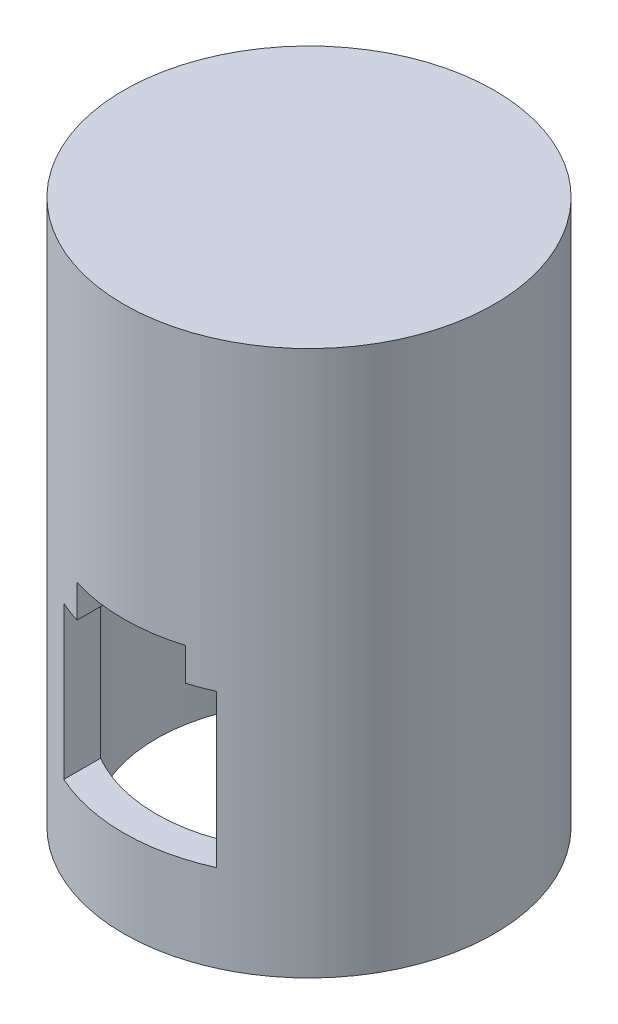
ISO-10303-21;
HEADER;
FILE_DESCRIPTION(('STEP AP214'),'2;1');
FILE_NAME('part.step','',(''),(''),'','','');
FILE_SCHEMA(('AUTOMOTIVE_DESIGN { 1 0 10303 214 1 1 1 1 }'));
ENDSEC;
DATA;
#1=APPLICATION_CONTEXT('core data for automotive mechanical design processes');
#2=APPLICATION_PROTOCOL_DEFINITION('international standard','automotive_design',2000,#1);
#3=PRODUCT_CONTEXT('',#1,'mechanical');
#4=PRODUCT('Part','Part','',(#3));
#5=PRODUCT_RELATED_PRODUCT_CATEGORY('part','',(#4));
#6=PRODUCT_DEFINITION_FORMATION('','',#4);
#7=PRODUCT_DEFINITION_CONTEXT('part definition',#1,'design');
#8=PRODUCT_DEFINITION('design','',#6,#7);
#9=PRODUCT_DEFINITION_SHAPE('','',#8);
#10=(LENGTH_UNIT() NAMED_UNIT(*) SI_UNIT(.MILLI.,.METRE.));
#11=(NAMED_UNIT(*) PLANE_ANGLE_UNIT() SI_UNIT($,.RADIAN.));
#12=(NAMED_UNIT(*) SI_UNIT($,.STERADIAN.) SOLID_ANGLE_UNIT());
#13=UNCERTAINTY_MEASURE_WITH_UNIT(LENGTH_MEASURE(1.E-05),#10,'distance_accuracy_value','');
#14=(GEOMETRIC_REPRESENTATION_CONTEXT(3) GLOBAL_UNCERTAINTY_ASSIGNED_CONTEXT((#13)) GLOBAL_UNIT_ASSIGNED_CONTEXT((#10,
#11,#12)) REPRESENTATION_CONTEXT('',''));
#15=CARTESIAN_POINT('',(0.,0.,0.));
#16=DIRECTION('',(0.,0.,1.));
#17=DIRECTION('',(1.,0.,0.));
#18=AXIS2_PLACEMENT_3D('',#15,#16,#17);
#19=CARTESIAN_POINT('',(7.,22.,-17.));
#20=DIRECTION('',(0.,1.,0.));
#21=DIRECTION('',(-1.,0.,0.));
#22=AXIS2_PLACEMENT_3D('',#19,#20,#21);
#23=PLANE('',#22);
#24=CARTESIAN_POINT('',(0.,22.,0.));
#25=DIRECTION('',(0.,1.,0.));
#26=DIRECTION('',(-1.,0.,0.));
#27=AXIS2_PLACEMENT_3D('',#24,#25,#26);
#28=CIRCLE('',#27,17.);
#29=CARTESIAN_POINT('',(-5.04900382672982,22.,-16.2329159536316));
#30=VERTEX_POINT('',#29);
#31=CARTESIAN_POINT('',(-7.,22.,-15.4919333848297));
#32=VERTEX_POINT('',#31);
#33=EDGE_CURVE('E240',#30,#32,#28,.T.);
#34=ORIENTED_EDGE('',*,*,#33,.F.);
#35=DIRECTION('',(0.,0.,1.));
#36=VECTOR('',#35,1.);
#37=CARTESIAN_POINT('',(-5.04900382672982,22.,-17.));
#38=LINE('',#37,#36);
#39=CARTESIAN_POINT('',(-5.04900382672982,22.,-13.0578543550488));
#40=VERTEX_POINT('',#39);
#41=EDGE_CURVE('E193',#30,#40,#38,.T.);
#42=ORIENTED_EDGE('',*,*,#41,.T.);
#43=CARTESIAN_POINT('',(0.,22.,0.));
#44=DIRECTION('',(0.,1.,0.));
#45=DIRECTION('',(-1.,0.,0.));
#46=AXIS2_PLACEMENT_3D('',#43,#44,#45);
#47=CIRCLE('',#46,14.);
#48=CARTESIAN_POINT('',(-7.,22.,-12.1243556529821));
#49=VERTEX_POINT('',#48);
#50=EDGE_CURVE('E275',#49,#40,#47,.F.);
#51=ORIENTED_EDGE('',*,*,#50,.F.);
#52=DIRECTION('',(0.,0.,1.));
#53=VECTOR('',#52,1.);
#54=CARTESIAN_POINT('',(-7.,22.,-17.));
#55=LINE('',#54,#53);
#56=EDGE_CURVE('E213',#32,#49,#55,.T.);
#57=ORIENTED_EDGE('',*,*,#56,.F.);
#58=EDGE_LOOP('',(#34,#42,#51,#57));
#59=FACE_BOUND('',#58,.T.);
#60=ADVANCED_FACE('F39',(#59),#23,.F.);
#61=CARTESIAN_POINT('',(-5.04900382672982,22.,13.0578543550488));
#62=VERTEX_POINT('',#61);
#63=CARTESIAN_POINT('',(-7.,22.,12.1243556529821));
#64=VERTEX_POINT('',#63);
#65=EDGE_CURVE('E288',#62,#64,#47,.F.);
#66=ORIENTED_EDGE('',*,*,#65,.F.);
#67=DIRECTION('',(0.,0.,1.));
#68=VECTOR('',#67,1.);
#69=CARTESIAN_POINT('',(-5.04900382672982,22.,-17.));
#70=LINE('',#69,#68);
#71=CARTESIAN_POINT('',(-5.04900382672982,22.,16.2329159536316));
#72=VERTEX_POINT('',#71);
#73=EDGE_CURVE('E295',#62,#72,#70,.T.);
#74=ORIENTED_EDGE('',*,*,#73,.T.);
#75=CARTESIAN_POINT('',(-7.,22.,15.4919333848297));
#76=VERTEX_POINT('',#75);
#77=EDGE_CURVE('E241',#76,#72,#28,.T.);
#78=ORIENTED_EDGE('',*,*,#77,.F.);
#79=EDGE_CURVE('E209',#64,#76,#55,.T.);
#80=ORIENTED_EDGE('',*,*,#79,.F.);
#81=EDGE_LOOP('',(#66,#74,#78,#80));
#82=FACE_BOUND('',#81,.T.);
#83=ADVANCED_FACE('F338',(#82),#23,.F.);
#84=CARTESIAN_POINT('',(0.,30.,0.));
#85=DIRECTION('',(0.,-1.,0.));
#86=DIRECTION('',(0.,0.,-1.));
#87=AXIS2_PLACEMENT_3D('',#84,#85,#86);
#88=CYLINDRICAL_SURFACE('',#87,17.);
#89=DIRECTION('',(0.,-1.,0.));
#90=VECTOR('',#89,1.);
#91=CARTESIAN_POINT('',(4.95099617327018,30.,-16.26307587427));
#92=LINE('',#91,#90);
#93=CARTESIAN_POINT('',(4.95099617327018,22.,-16.26307587427));
#94=VERTEX_POINT('',#93);
#95=CARTESIAN_POINT('',(4.95099617327018,25.,-16.26307587427));
#96=VERTEX_POINT('',#95);
#97=EDGE_CURVE('E55',#94,#96,#92,.F.);
#98=ORIENTED_EDGE('',*,*,#97,.T.);
#99=CARTESIAN_POINT('',(0.,25.,0.));
#100=DIRECTION('',(0.,1.,0.));
#101=DIRECTION('',(0.,0.,1.));
#102=AXIS2_PLACEMENT_3D('',#99,#100,#101);
#103=CIRCLE('',#102,17.);
#104=CARTESIAN_POINT('',(-5.04900382672982,25.,-16.2329159536316));
#105=VERTEX_POINT('',#104);
#106=EDGE_CURVE('E155',#96,#105,#103,.T.);
#107=ORIENTED_EDGE('',*,*,#106,.T.);
#108=DIRECTION('',(0.,-1.,0.));
#109=VECTOR('',#108,1.);
#110=CARTESIAN_POINT('',(-5.04900382672982,30.,-16.2329159536316));
#111=LINE('',#110,#109);
#112=EDGE_CURVE('E201',#105,#30,#111,.T.);
#113=ORIENTED_EDGE('',*,*,#112,.T.);
#114=ORIENTED_EDGE('',*,*,#33,.T.);
#115=DIRECTION('',(0.,-1.,0.));
#116=VECTOR('',#115,1.);
#117=CARTESIAN_POINT('',(-7.,30.,-15.4919333848297));
#118=LINE('',#117,#116);
#119=CARTESIAN_POINT('',(-7.,8.,-15.4919333848297));
#120=VERTEX_POINT('',#119);
#121=EDGE_CURVE('E250',#32,#120,#118,.T.);
#122=ORIENTED_EDGE('',*,*,#121,.T.);
#123=CARTESIAN_POINT('',(0.,8.,0.));
#124=DIRECTION('',(0.,-1.,0.));
#125=DIRECTION('',(0.,0.,-1.));
#126=AXIS2_PLACEMENT_3D('',#123,#124,#125);
#127=CIRCLE('',#126,17.);
#128=CARTESIAN_POINT('',(7.,8.,-15.4919333848297));
#129=VERTEX_POINT('',#128);
#130=EDGE_CURVE('E229',#120,#129,#127,.T.);
#131=ORIENTED_EDGE('',*,*,#130,.T.);
#132=DIRECTION('',(0.,-1.,0.));
#133=VECTOR('',#132,1.);
#134=CARTESIAN_POINT('',(7.,30.,-15.4919333848297));
#135=LINE('',#134,#133);
#136=CARTESIAN_POINT('',(7.,22.,-15.4919333848297));
#137=VERTEX_POINT('',#136);
#138=EDGE_CURVE('E233',#129,#137,#135,.F.);
#139=ORIENTED_EDGE('',*,*,#138,.T.);
#140=EDGE_CURVE('E177',#137,#94,#28,.T.);
#141=ORIENTED_EDGE('',*,*,#140,.T.);
#142=EDGE_LOOP('',(#98,#107,#113,#114,#122,#131,#139,#141));
#143=FACE_BOUND('',#142,.T.);
#144=CARTESIAN_POINT('',(-5.04900382672982,25.,16.2329159536316));
#145=VERTEX_POINT('',#144);
#146=CARTESIAN_POINT('',(4.95099617327018,25.,16.26307587427));
#147=VERTEX_POINT('',#146);
#148=EDGE_CURVE('E165',#145,#147,#103,.T.);
#149=ORIENTED_EDGE('',*,*,#148,.T.);
#150=DIRECTION('',(0.,-1.,0.));
#151=VECTOR('',#150,1.);
#152=CARTESIAN_POINT('',(4.95099617327018,30.,16.26307587427));
#153=LINE('',#152,#151);
#154=CARTESIAN_POINT('',(4.95099617327018,22.,16.26307587427));
#155=VERTEX_POINT('',#154);
#156=EDGE_CURVE('E314',#147,#155,#153,.T.);
#157=ORIENTED_EDGE('',*,*,#156,.T.);
#158=CARTESIAN_POINT('',(7.,22.,15.4919333848297));
#159=VERTEX_POINT('',#158);
#160=EDGE_CURVE('E246',#155,#159,#28,.T.);
#161=ORIENTED_EDGE('',*,*,#160,.T.);
#162=DIRECTION('',(0.,-1.,0.));
#163=VECTOR('',#162,1.);
#164=CARTESIAN_POINT('',(7.,30.,15.4919333848297));
#165=LINE('',#164,#163);
#166=CARTESIAN_POINT('',(7.,8.,15.4919333848297));
#167=VERTEX_POINT('',#166);
#168=EDGE_CURVE('E236',#159,#167,#165,.T.);
#169=ORIENTED_EDGE('',*,*,#168,.T.);
#170=CARTESIAN_POINT('',(-7.,8.,15.4919333848297));
#171=VERTEX_POINT('',#170);
#172=EDGE_CURVE('E232',#167,#171,#127,.T.);
#173=ORIENTED_EDGE('',*,*,#172,.T.);
#174=DIRECTION('',(0.,-1.,0.));
#175=VECTOR('',#174,1.);
#176=CARTESIAN_POINT('',(-7.,30.,15.4919333848297));
#177=LINE('',#176,#175);
#178=EDGE_CURVE('E245',#171,#76,#177,.F.);
#179=ORIENTED_EDGE('',*,*,#178,.T.);
#180=ORIENTED_EDGE('',*,*,#77,.T.);
#181=DIRECTION('',(0.,-1.,0.));
#182=VECTOR('',#181,1.);
#183=CARTESIAN_POINT('',(-5.04900382672982,30.,16.2329159536316));
#184=LINE('',#183,#182);
#185=EDGE_CURVE('E184',#72,#145,#184,.F.);
#186=ORIENTED_EDGE('',*,*,#185,.T.);
#187=EDGE_LOOP('',(#149,#157,#161,#169,#173,#179,#180,#186));
#188=FACE_BOUND('',#187,.T.);
#189=CARTESIAN_POINT('',(0.,0.,0.));
#190=DIRECTION('',(0.,1.,0.));
#191=DIRECTION('',(0.,0.,1.));
#192=AXIS2_PLACEMENT_3D('',#189,#190,#191);
#193=CIRCLE('',#192,17.);
#194=CARTESIAN_POINT('',(0.,0.,17.));
#195=VERTEX_POINT('',#194);
#196=EDGE_CURVE('E258',#195,#195,#193,.T.);
#197=ORIENTED_EDGE('',*,*,#196,.T.);
#198=EDGE_LOOP('',(#197));
#199=FACE_BOUND('',#198,.T.);
#200=CARTESIAN_POINT('',(0.,50.,0.));
#201=DIRECTION('',(0.,1.,0.));
#202=DIRECTION('',(0.,0.,1.));
#203=AXIS2_PLACEMENT_3D('',#200,#201,#202);
#204=CIRCLE('',#203,17.);
#205=CARTESIAN_POINT('',(0.,50.,17.));
#206=VERTEX_POINT('',#205);
#207=EDGE_CURVE('E164',#206,#206,#204,.T.);
#208=ORIENTED_EDGE('',*,*,#207,.F.);
#209=EDGE_LOOP('',(#208));
#210=FACE_BOUND('',#209,.T.);
#211=ADVANCED_FACE('F41',(#143,#188,#199,#210),#88,.T.);
#212=CARTESIAN_POINT('',(0.,0.,0.));
#213=DIRECTION('',(0.,1.,0.));
#214=DIRECTION('',(0.,0.,1.));
#215=AXIS2_PLACEMENT_3D('',#212,#213,#214);
#216=PLANE('',#215);
#217=CARTESIAN_POINT('',(0.,0.,0.));
#218=DIRECTION('',(0.,1.,0.));
#219=DIRECTION('',(0.,0.,1.));
#220=AXIS2_PLACEMENT_3D('',#217,#218,#219);
#221=CIRCLE('',#220,14.);
#222=CARTESIAN_POINT('',(0.,0.,14.));
#223=VERTEX_POINT('',#222);
#224=EDGE_CURVE('E254',#223,#223,#221,.T.);
#225=ORIENTED_EDGE('',*,*,#224,.T.);
#226=EDGE_LOOP('',(#225));
#227=FACE_BOUND('',#226,.T.);
#228=ORIENTED_EDGE('',*,*,#196,.F.);
#229=EDGE_LOOP('',(#228));
#230=FACE_BOUND('',#229,.T.);
#231=ADVANCED_FACE('F404',(#227,#230),#216,.F.);
#232=CARTESIAN_POINT('',(0.,0.,0.));
#233=DIRECTION('',(0.,1.,0.));
#234=DIRECTION('',(0.,0.,1.));
#235=AXIS2_PLACEMENT_3D('',#232,#233,#234);
#236=CYLINDRICAL_SURFACE('',#235,14.);
#237=CARTESIAN_POINT('',(0.,25.,0.));
#238=DIRECTION('',(0.,1.,0.));
#239=DIRECTION('',(0.,0.,1.));
#240=AXIS2_PLACEMENT_3D('',#237,#238,#239);
#241=CIRCLE('',#240,14.);
#242=CARTESIAN_POINT('',(4.95099617327018,25.,13.0953288195549));
#243=VERTEX_POINT('',#242);
#244=CARTESIAN_POINT('',(-5.04900382672982,25.,13.0578543550488));
#245=VERTEX_POINT('',#244);
#246=EDGE_CURVE('E43',#243,#245,#241,.F.);
#247=ORIENTED_EDGE('',*,*,#246,.T.);
#248=DIRECTION('',(0.,1.,0.));
#249=VECTOR('',#248,1.);
#250=CARTESIAN_POINT('',(-5.04900382672982,0.,13.0578543550488));
#251=LINE('',#250,#249);
#252=EDGE_CURVE('E179',#245,#62,#251,.F.);
#253=ORIENTED_EDGE('',*,*,#252,.T.);
#254=ORIENTED_EDGE('',*,*,#65,.T.);
#255=DIRECTION('',(0.,1.,0.));
#256=VECTOR('',#255,1.);
#257=CARTESIAN_POINT('',(-7.,0.,12.1243556529821));
#258=LINE('',#257,#256);
#259=CARTESIAN_POINT('',(-7.,8.,12.1243556529821));
#260=VERTEX_POINT('',#259);
#261=EDGE_CURVE('E289',#64,#260,#258,.F.);
#262=ORIENTED_EDGE('',*,*,#261,.T.);
#263=CARTESIAN_POINT('',(0.,8.,0.));
#264=DIRECTION('',(0.,-1.,0.));
#265=DIRECTION('',(0.,0.,-1.));
#266=AXIS2_PLACEMENT_3D('',#263,#264,#265);
#267=CIRCLE('',#266,14.);
#268=CARTESIAN_POINT('',(7.,8.,12.1243556529821));
#269=VERTEX_POINT('',#268);
#270=EDGE_CURVE('E270',#260,#269,#267,.F.);
#271=ORIENTED_EDGE('',*,*,#270,.T.);
#272=DIRECTION('',(0.,1.,0.));
#273=VECTOR('',#272,1.);
#274=CARTESIAN_POINT('',(7.,0.,12.1243556529821));
#275=LINE('',#274,#273);
#276=CARTESIAN_POINT('',(7.,22.,12.1243556529821));
#277=VERTEX_POINT('',#276);
#278=EDGE_CURVE('E284',#269,#277,#275,.T.);
#279=ORIENTED_EDGE('',*,*,#278,.T.);
#280=CARTESIAN_POINT('',(4.95099617327018,22.,13.0953288195549));
#281=VERTEX_POINT('',#280);
#282=EDGE_CURVE('E280',#277,#281,#47,.F.);
#283=ORIENTED_EDGE('',*,*,#282,.T.);
#284=DIRECTION('',(0.,1.,0.));
#285=VECTOR('',#284,1.);
#286=CARTESIAN_POINT('',(4.95099617327019,0.,13.0953288195549));
#287=LINE('',#286,#285);
#288=EDGE_CURVE('E63',#281,#243,#287,.T.);
#289=ORIENTED_EDGE('',*,*,#288,.T.);
#290=EDGE_LOOP('',(#247,#253,#254,#262,#271,#279,#283,#289));
#291=FACE_BOUND('',#290,.T.);
#292=ORIENTED_EDGE('',*,*,#50,.T.);
#293=DIRECTION('',(0.,1.,0.));
#294=VECTOR('',#293,1.);
#295=CARTESIAN_POINT('',(-5.04900382672982,0.,-13.0578543550488));
#296=LINE('',#295,#294);
#297=CARTESIAN_POINT('',(-5.04900382672982,25.,-13.0578543550488));
#298=VERTEX_POINT('',#297);
#299=EDGE_CURVE('E197',#40,#298,#296,.T.);
#300=ORIENTED_EDGE('',*,*,#299,.T.);
#301=CARTESIAN_POINT('',(4.95099617327018,25.,-13.0953288195549));
#302=VERTEX_POINT('',#301);
#303=EDGE_CURVE('E11',#298,#302,#241,.F.);
#304=ORIENTED_EDGE('',*,*,#303,.T.);
#305=DIRECTION('',(0.,1.,0.));
#306=VECTOR('',#305,1.);
#307=CARTESIAN_POINT('',(4.95099617327019,0.,-13.0953288195549));
#308=LINE('',#307,#306);
#309=CARTESIAN_POINT('',(4.95099617327018,22.,-13.0953288195549));
#310=VERTEX_POINT('',#309);
#311=EDGE_CURVE('E169',#302,#310,#308,.F.);
#312=ORIENTED_EDGE('',*,*,#311,.T.);
#313=CARTESIAN_POINT('',(7.,22.,-12.1243556529821));
#314=VERTEX_POINT('',#313);
#315=EDGE_CURVE('E274',#310,#314,#47,.F.);
#316=ORIENTED_EDGE('',*,*,#315,.T.);
#317=DIRECTION('',(0.,1.,0.));
#318=VECTOR('',#317,1.);
#319=CARTESIAN_POINT('',(7.,0.,-12.1243556529821));
#320=LINE('',#319,#318);
#321=CARTESIAN_POINT('',(7.,8.,-12.1243556529821));
#322=VERTEX_POINT('',#321);
#323=EDGE_CURVE('E269',#314,#322,#320,.F.);
#324=ORIENTED_EDGE('',*,*,#323,.T.);
#325=CARTESIAN_POINT('',(-7.,8.,-12.1243556529821));
#326=VERTEX_POINT('',#325);
#327=EDGE_CURVE('E265',#322,#326,#267,.F.);
#328=ORIENTED_EDGE('',*,*,#327,.T.);
#329=DIRECTION('',(0.,1.,0.));
#330=VECTOR('',#329,1.);
#331=CARTESIAN_POINT('',(-7.,0.,-12.1243556529821));
#332=LINE('',#331,#330);
#333=EDGE_CURVE('E279',#326,#49,#332,.T.);
#334=ORIENTED_EDGE('',*,*,#333,.T.);
#335=EDGE_LOOP('',(#292,#300,#304,#312,#316,#324,#328,#334));
#336=FACE_BOUND('',#335,.T.);
#337=ORIENTED_EDGE('',*,*,#224,.F.);
#338=EDGE_LOOP('',(#337));
#339=FACE_BOUND('',#338,.T.);
#340=CARTESIAN_POINT('',(0.,30.,0.));
#341=DIRECTION('',(0.,1.,0.));
#342=DIRECTION('',(0.,0.,1.));
#343=AXIS2_PLACEMENT_3D('',#340,#341,#342);
#344=CIRCLE('',#343,14.);
#345=CARTESIAN_POINT('',(0.,30.,14.));
#346=VERTEX_POINT('',#345);
#347=EDGE_CURVE('E208',#346,#346,#344,.T.);
#348=ORIENTED_EDGE('',*,*,#347,.T.);
#349=EDGE_LOOP('',(#348));
#350=FACE_BOUND('',#349,.T.);
#351=ADVANCED_FACE('F303',(#291,#336,#339,#350),#236,.F.);
#352=CARTESIAN_POINT('',(7.,8.,-17.));
#353=DIRECTION('',(0.,-1.,0.));
#354=DIRECTION('',(0.,0.,-1.));
#355=AXIS2_PLACEMENT_3D('',#352,#353,#354);
#356=PLANE('',#355);
#357=ORIENTED_EDGE('',*,*,#130,.F.);
#358=DIRECTION('',(0.,0.,1.));
#359=VECTOR('',#358,1.);
#360=CARTESIAN_POINT('',(-7.,8.,-17.));
#361=LINE('',#360,#359);
#362=EDGE_CURVE('E224',#120,#326,#361,.T.);
#363=ORIENTED_EDGE('',*,*,#362,.T.);
#364=ORIENTED_EDGE('',*,*,#327,.F.);
#365=DIRECTION('',(0.,0.,1.));
#366=VECTOR('',#365,1.);
#367=CARTESIAN_POINT('',(7.,8.,-17.));
#368=LINE('',#367,#366);
#369=EDGE_CURVE('E219',#129,#322,#368,.T.);
#370=ORIENTED_EDGE('',*,*,#369,.F.);
#371=EDGE_LOOP('',(#357,#363,#364,#370));
#372=FACE_BOUND('',#371,.T.);
#373=ADVANCED_FACE('F360',(#372),#356,.F.);
#374=CARTESIAN_POINT('',(7.,22.,-17.));
#375=DIRECTION('',(1.,0.,0.));
#376=DIRECTION('',(0.,1.,0.));
#377=AXIS2_PLACEMENT_3D('',#374,#375,#376);
#378=PLANE('',#377);
#379=ORIENTED_EDGE('',*,*,#369,.T.);
#380=ORIENTED_EDGE('',*,*,#323,.F.);
#381=DIRECTION('',(0.,0.,1.));
#382=VECTOR('',#381,1.);
#383=CARTESIAN_POINT('',(7.,22.,-17.));
#384=LINE('',#383,#382);
#385=EDGE_CURVE('E214',#137,#314,#384,.T.);
#386=ORIENTED_EDGE('',*,*,#385,.F.);
#387=ORIENTED_EDGE('',*,*,#138,.F.);
#388=EDGE_LOOP('',(#379,#380,#386,#387));
#389=FACE_BOUND('',#388,.T.);
#390=ADVANCED_FACE('F367',(#389),#378,.F.);
#391=ORIENTED_EDGE('',*,*,#315,.F.);
#392=DIRECTION('',(0.,0.,-1.));
#393=VECTOR('',#392,1.);
#394=CARTESIAN_POINT('',(4.95099617327018,22.,-17.));
#395=LINE('',#394,#393);
#396=EDGE_CURVE('E186',#310,#94,#395,.T.);
#397=ORIENTED_EDGE('',*,*,#396,.T.);
#398=ORIENTED_EDGE('',*,*,#140,.F.);
#399=ORIENTED_EDGE('',*,*,#385,.T.);
#400=EDGE_LOOP('',(#391,#397,#398,#399));
#401=FACE_BOUND('',#400,.T.);
#402=ADVANCED_FACE('F324',(#401),#23,.F.);
#403=CARTESIAN_POINT('',(-7.,22.,-17.));
#404=DIRECTION('',(-1.,0.,0.));
#405=DIRECTION('',(0.,0.,1.));
#406=AXIS2_PLACEMENT_3D('',#403,#404,#405);
#407=PLANE('',#406);
#408=ORIENTED_EDGE('',*,*,#56,.T.);
#409=ORIENTED_EDGE('',*,*,#333,.F.);
#410=ORIENTED_EDGE('',*,*,#362,.F.);
#411=ORIENTED_EDGE('',*,*,#121,.F.);
#412=EDGE_LOOP('',(#408,#409,#410,#411));
#413=FACE_BOUND('',#412,.T.);
#414=ADVANCED_FACE('F364',(#413),#407,.F.);
#415=EDGE_CURVE('E225',#260,#171,#361,.T.);
#416=ORIENTED_EDGE('',*,*,#415,.F.);
#417=ORIENTED_EDGE('',*,*,#261,.F.);
#418=ORIENTED_EDGE('',*,*,#79,.T.);
#419=ORIENTED_EDGE('',*,*,#178,.F.);
#420=EDGE_LOOP('',(#416,#417,#418,#419));
#421=FACE_BOUND('',#420,.T.);
#422=ADVANCED_FACE('F342',(#421),#407,.F.);
#423=ORIENTED_EDGE('',*,*,#160,.F.);
#424=DIRECTION('',(0.,0.,-1.));
#425=VECTOR('',#424,1.);
#426=CARTESIAN_POINT('',(4.95099617327018,22.,-17.));
#427=LINE('',#426,#425);
#428=EDGE_CURVE('E293',#155,#281,#427,.T.);
#429=ORIENTED_EDGE('',*,*,#428,.T.);
#430=ORIENTED_EDGE('',*,*,#282,.F.);
#431=EDGE_CURVE('E215',#277,#159,#384,.T.);
#432=ORIENTED_EDGE('',*,*,#431,.T.);
#433=EDGE_LOOP('',(#423,#429,#430,#432));
#434=FACE_BOUND('',#433,.T.);
#435=ADVANCED_FACE('F373',(#434),#23,.F.);
#436=ORIENTED_EDGE('',*,*,#431,.F.);
#437=ORIENTED_EDGE('',*,*,#278,.F.);
#438=EDGE_CURVE('E220',#269,#167,#368,.T.);
#439=ORIENTED_EDGE('',*,*,#438,.T.);
#440=ORIENTED_EDGE('',*,*,#168,.F.);
#441=EDGE_LOOP('',(#436,#437,#439,#440));
#442=FACE_BOUND('',#441,.T.);
#443=ADVANCED_FACE('F380',(#442),#378,.F.);
#444=ORIENTED_EDGE('',*,*,#438,.F.);
#445=ORIENTED_EDGE('',*,*,#270,.F.);
#446=ORIENTED_EDGE('',*,*,#415,.T.);
#447=ORIENTED_EDGE('',*,*,#172,.F.);
#448=EDGE_LOOP('',(#444,#445,#446,#447));
#449=FACE_BOUND('',#448,.T.);
#450=ADVANCED_FACE('F386',(#449),#356,.F.);
#451=CARTESIAN_POINT('',(0.,30.,0.));
#452=DIRECTION('',(0.,1.,0.));
#453=DIRECTION('',(0.,0.,1.));
#454=AXIS2_PLACEMENT_3D('',#451,#452,#453);
#455=PLANE('',#454);
#456=ORIENTED_EDGE('',*,*,#347,.F.);
#457=EDGE_LOOP('',(#456));
#458=FACE_BOUND('',#457,.T.);
#459=ADVANCED_FACE('F400',(#458),#455,.F.);
#460=CARTESIAN_POINT('',(0.,50.,0.));
#461=DIRECTION('',(0.,1.,0.));
#462=DIRECTION('',(0.,0.,1.));
#463=AXIS2_PLACEMENT_3D('',#460,#461,#462);
#464=PLANE('',#463);
#465=ORIENTED_EDGE('',*,*,#207,.T.);
#466=EDGE_LOOP('',(#465));
#467=FACE_BOUND('',#466,.T.);
#468=ADVANCED_FACE('F416',(#467),#464,.T.);
#469=CARTESIAN_POINT('',(-5.04900382672982,25.,-17.));
#470=DIRECTION('',(-1.,0.,0.));
#471=DIRECTION('',(0.,0.,1.));
#472=AXIS2_PLACEMENT_3D('',#469,#470,#471);
#473=PLANE('',#472);
#474=ORIENTED_EDGE('',*,*,#73,.F.);
#475=ORIENTED_EDGE('',*,*,#252,.F.);
#476=DIRECTION('',(0.,0.,1.));
#477=VECTOR('',#476,1.);
#478=CARTESIAN_POINT('',(-5.04900382672982,25.,-17.));
#479=LINE('',#478,#477);
#480=EDGE_CURVE('E171',#245,#145,#479,.T.);
#481=ORIENTED_EDGE('',*,*,#480,.T.);
#482=ORIENTED_EDGE('',*,*,#185,.F.);
#483=EDGE_LOOP('',(#474,#475,#481,#482));
#484=FACE_BOUND('',#483,.T.);
#485=ADVANCED_FACE('F334',(#484),#473,.F.);
#486=CARTESIAN_POINT('',(4.95099617327018,25.,-17.));
#487=DIRECTION('',(1.,0.,0.));
#488=DIRECTION('',(0.,1.,0.));
#489=AXIS2_PLACEMENT_3D('',#486,#487,#488);
#490=PLANE('',#489);
#491=DIRECTION('',(0.,0.,1.));
#492=VECTOR('',#491,1.);
#493=CARTESIAN_POINT('',(4.95099617327018,25.,-17.));
#494=LINE('',#493,#492);
#495=EDGE_CURVE('E172',#243,#147,#494,.T.);
#496=ORIENTED_EDGE('',*,*,#495,.F.);
#497=ORIENTED_EDGE('',*,*,#288,.F.);
#498=ORIENTED_EDGE('',*,*,#428,.F.);
#499=ORIENTED_EDGE('',*,*,#156,.F.);
#500=EDGE_LOOP('',(#496,#497,#498,#499));
#501=FACE_BOUND('',#500,.T.);
#502=ADVANCED_FACE('F312',(#501),#490,.F.);
#503=CARTESIAN_POINT('',(4.95099617327018,25.,-17.));
#504=DIRECTION('',(0.,1.,0.));
#505=DIRECTION('',(0.,0.,1.));
#506=AXIS2_PLACEMENT_3D('',#503,#504,#505);
#507=PLANE('',#506);
#508=ORIENTED_EDGE('',*,*,#148,.F.);
#509=ORIENTED_EDGE('',*,*,#480,.F.);
#510=ORIENTED_EDGE('',*,*,#246,.F.);
#511=ORIENTED_EDGE('',*,*,#495,.T.);
#512=EDGE_LOOP('',(#508,#509,#510,#511));
#513=FACE_BOUND('',#512,.T.);
#514=ADVANCED_FACE('F309',(#513),#507,.F.);
#515=EDGE_CURVE('E157',#96,#302,#494,.T.);
#516=ORIENTED_EDGE('',*,*,#515,.T.);
#517=ORIENTED_EDGE('',*,*,#303,.F.);
#518=EDGE_CURVE('E159',#105,#298,#479,.T.);
#519=ORIENTED_EDGE('',*,*,#518,.F.);
#520=ORIENTED_EDGE('',*,*,#106,.F.);
#521=EDGE_LOOP('',(#516,#517,#519,#520));
#522=FACE_BOUND('',#521,.T.);
#523=ADVANCED_FACE('F156',(#522),#507,.F.);
#524=ORIENTED_EDGE('',*,*,#518,.T.);
#525=ORIENTED_EDGE('',*,*,#299,.F.);
#526=ORIENTED_EDGE('',*,*,#41,.F.);
#527=ORIENTED_EDGE('',*,*,#112,.F.);
#528=EDGE_LOOP('',(#524,#525,#526,#527));
#529=FACE_BOUND('',#528,.T.);
#530=ADVANCED_FACE('F330',(#529),#473,.F.);
#531=ORIENTED_EDGE('',*,*,#396,.F.);
#532=ORIENTED_EDGE('',*,*,#311,.F.);
#533=ORIENTED_EDGE('',*,*,#515,.F.);
#534=ORIENTED_EDGE('',*,*,#97,.F.);
#535=EDGE_LOOP('',(#531,#532,#533,#534));
#536=FACE_BOUND('',#535,.T.);
#537=ADVANCED_FACE('F167',(#536),#490,.F.);
#538=CLOSED_SHELL('',(#60,#83,#211,#231,#351,#373,#390,#402,#414,#422,#435,#443,#450,#459,#468,
#485,#502,#514,#523,#530,#537));
#539=MANIFOLD_SOLID_BREP('B2',#538);
#540=ADVANCED_BREP_SHAPE_REPRESENTATION('',(#18,#539),#14);
#541=SHAPE_DEFINITION_REPRESENTATION(#9,#540);
ENDSEC;
END-ISO-10303-21;
